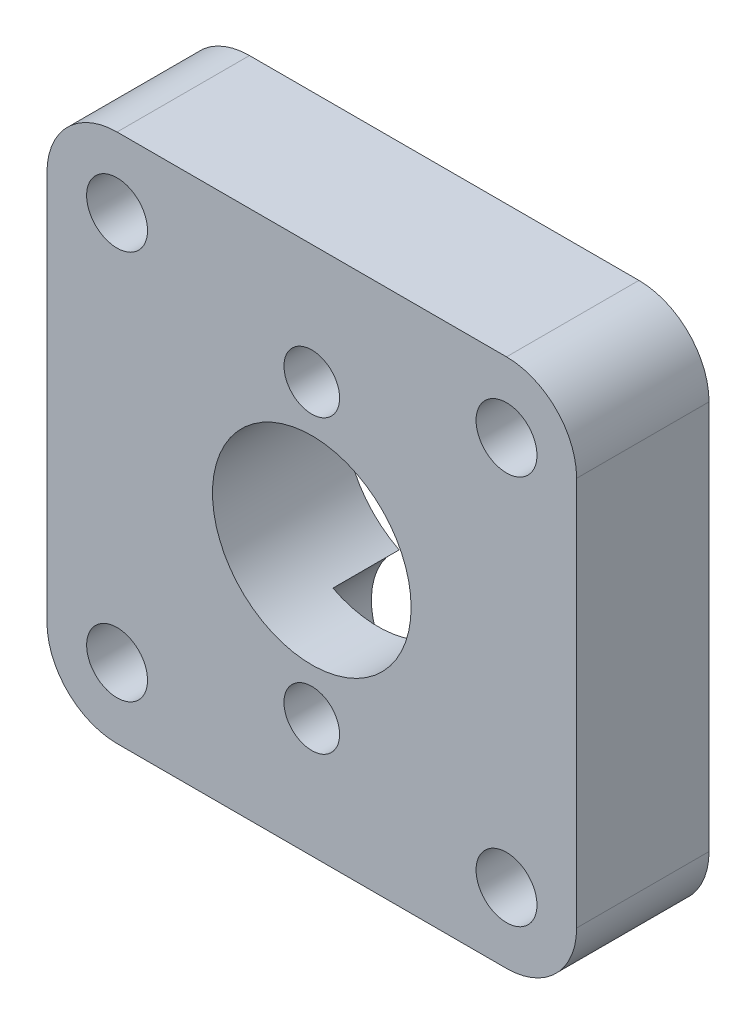
ISO-10303-21;
HEADER;
FILE_DESCRIPTION(('STEP AP214'),'2;1');
FILE_NAME('part.step','',(''),(''),'','','');
FILE_SCHEMA(('AUTOMOTIVE_DESIGN { 1 0 10303 214 1 1 1 1 }'));
ENDSEC;
DATA;
#1=APPLICATION_CONTEXT('core data for automotive mechanical design processes');
#2=APPLICATION_PROTOCOL_DEFINITION('international standard','automotive_design',2000,#1);
#3=PRODUCT_CONTEXT('',#1,'mechanical');
#4=PRODUCT('Part','Part','',(#3));
#5=PRODUCT_RELATED_PRODUCT_CATEGORY('part','',(#4));
#6=PRODUCT_DEFINITION_FORMATION('','',#4);
#7=PRODUCT_DEFINITION_CONTEXT('part definition',#1,'design');
#8=PRODUCT_DEFINITION('design','',#6,#7);
#9=PRODUCT_DEFINITION_SHAPE('','',#8);
#10=(LENGTH_UNIT() NAMED_UNIT(*) SI_UNIT(.MILLI.,.METRE.));
#11=(NAMED_UNIT(*) PLANE_ANGLE_UNIT() SI_UNIT($,.RADIAN.));
#12=(NAMED_UNIT(*) SI_UNIT($,.STERADIAN.) SOLID_ANGLE_UNIT());
#13=UNCERTAINTY_MEASURE_WITH_UNIT(LENGTH_MEASURE(1.E-05),#10,'distance_accuracy_value','');
#14=(GEOMETRIC_REPRESENTATION_CONTEXT(3) GLOBAL_UNCERTAINTY_ASSIGNED_CONTEXT((#13)) GLOBAL_UNIT_ASSIGNED_CONTEXT((#10,
#11,#12)) REPRESENTATION_CONTEXT('',''));
#15=CARTESIAN_POINT('',(0.,0.,0.));
#16=DIRECTION('',(0.,0.,1.));
#17=DIRECTION('',(1.,0.,0.));
#18=AXIS2_PLACEMENT_3D('',#15,#16,#17);
#19=CARTESIAN_POINT('',(-7.35229073212245,7.35229073212245,0.));
#20=DIRECTION('',(0.,0.,-1.));
#21=DIRECTION('',(1.,0.,0.));
#22=AXIS2_PLACEMENT_3D('',#19,#20,#21);
#23=CYLINDRICAL_SURFACE('',#22,1.15);
#24=CARTESIAN_POINT('',(-7.35229073212245,7.35229073212245,0.));
#25=DIRECTION('',(0.,0.,1.));
#26=DIRECTION('',(1.,0.,0.));
#27=AXIS2_PLACEMENT_3D('',#24,#25,#26);
#28=CIRCLE('',#27,1.15);
#29=CARTESIAN_POINT('',(-6.20229073212244,7.35229073212245,0.));
#30=VERTEX_POINT('',#29);
#31=EDGE_CURVE('E224',#30,#30,#28,.T.);
#32=ORIENTED_EDGE('',*,*,#31,.T.);
#33=EDGE_LOOP('',(#32));
#34=FACE_BOUND('',#33,.T.);
#35=CARTESIAN_POINT('',(-7.35229073212245,7.35229073212245,-2.));
#36=DIRECTION('',(0.,0.,1.));
#37=DIRECTION('',(1.,0.,0.));
#38=AXIS2_PLACEMENT_3D('',#35,#36,#37);
#39=CIRCLE('',#38,1.15);
#40=CARTESIAN_POINT('',(-6.20229073212244,7.35229073212245,-2.));
#41=VERTEX_POINT('',#40);
#42=EDGE_CURVE('E209',#41,#41,#39,.F.);
#43=ORIENTED_EDGE('',*,*,#42,.T.);
#44=EDGE_LOOP('',(#43));
#45=FACE_BOUND('',#44,.T.);
#46=ADVANCED_FACE('F39',(#34,#45),#23,.F.);
#47=CARTESIAN_POINT('',(7.35229073212245,-7.35229073212245,0.));
#48=DIRECTION('',(0.,0.,-1.));
#49=DIRECTION('',(1.,0.,0.));
#50=AXIS2_PLACEMENT_3D('',#47,#48,#49);
#51=CYLINDRICAL_SURFACE('',#50,1.15);
#52=CARTESIAN_POINT('',(7.35229073212245,-7.35229073212245,0.));
#53=DIRECTION('',(0.,0.,1.));
#54=DIRECTION('',(1.,0.,0.));
#55=AXIS2_PLACEMENT_3D('',#52,#53,#54);
#56=CIRCLE('',#55,1.15);
#57=CARTESIAN_POINT('',(8.50229073212244,-7.35229073212245,0.));
#58=VERTEX_POINT('',#57);
#59=EDGE_CURVE('E215',#58,#58,#56,.T.);
#60=ORIENTED_EDGE('',*,*,#59,.T.);
#61=EDGE_LOOP('',(#60));
#62=FACE_BOUND('',#61,.T.);
#63=CARTESIAN_POINT('',(7.35229073212245,-7.35229073212245,-2.));
#64=DIRECTION('',(0.,0.,1.));
#65=DIRECTION('',(1.,0.,0.));
#66=AXIS2_PLACEMENT_3D('',#63,#64,#65);
#67=CIRCLE('',#66,1.15);
#68=CARTESIAN_POINT('',(8.50229073212244,-7.35229073212245,-2.));
#69=VERTEX_POINT('',#68);
#70=EDGE_CURVE('E203',#69,#69,#67,.F.);
#71=ORIENTED_EDGE('',*,*,#70,.T.);
#72=EDGE_LOOP('',(#71));
#73=FACE_BOUND('',#72,.T.);
#74=ADVANCED_FACE('F305',(#62,#73),#51,.F.);
#75=CARTESIAN_POINT('',(0.,7.5,0.));
#76=DIRECTION('',(0.,0.,-1.));
#77=DIRECTION('',(1.,0.,0.));
#78=AXIS2_PLACEMENT_3D('',#75,#76,#77);
#79=PLANE('',#78);
#80=CARTESIAN_POINT('',(-7.35229073212245,-7.35229073212245,0.));
#81=DIRECTION('',(0.,0.,1.));
#82=DIRECTION('',(-1.,0.,0.));
#83=AXIS2_PLACEMENT_3D('',#80,#81,#82);
#84=CIRCLE('',#83,1.15);
#85=CARTESIAN_POINT('',(-8.50229073212244,-7.35229073212245,0.));
#86=VERTEX_POINT('',#85);
#87=EDGE_CURVE('E211',#86,#86,#84,.T.);
#88=ORIENTED_EDGE('',*,*,#87,.F.);
#89=EDGE_LOOP('',(#88));
#90=FACE_BOUND('',#89,.T.);
#91=ORIENTED_EDGE('',*,*,#59,.F.);
#92=EDGE_LOOP('',(#91));
#93=FACE_BOUND('',#92,.T.);
#94=CARTESIAN_POINT('',(7.35229073212245,7.35229073212245,0.));
#95=DIRECTION('',(0.,0.,1.));
#96=DIRECTION('',(-1.,0.,0.));
#97=AXIS2_PLACEMENT_3D('',#94,#95,#96);
#98=CIRCLE('',#97,1.15);
#99=CARTESIAN_POINT('',(6.20229073212244,7.35229073212245,0.));
#100=VERTEX_POINT('',#99);
#101=EDGE_CURVE('E220',#100,#100,#98,.T.);
#102=ORIENTED_EDGE('',*,*,#101,.F.);
#103=EDGE_LOOP('',(#102));
#104=FACE_BOUND('',#103,.T.);
#105=ORIENTED_EDGE('',*,*,#31,.F.);
#106=EDGE_LOOP('',(#105));
#107=FACE_BOUND('',#106,.T.);
#108=CARTESIAN_POINT('',(0.,5.5,0.));
#109=DIRECTION('',(0.,0.,1.));
#110=DIRECTION('',(1.,0.,0.));
#111=AXIS2_PLACEMENT_3D('',#108,#109,#110);
#112=CIRCLE('',#111,1.05);
#113=CARTESIAN_POINT('',(1.05,5.5,0.));
#114=VERTEX_POINT('',#113);
#115=EDGE_CURVE('E164',#114,#114,#112,.T.);
#116=ORIENTED_EDGE('',*,*,#115,.F.);
#117=EDGE_LOOP('',(#116));
#118=FACE_BOUND('',#117,.T.);
#119=CARTESIAN_POINT('',(0.,-5.5,0.));
#120=DIRECTION('',(0.,0.,1.));
#121=DIRECTION('',(-1.,0.,0.));
#122=AXIS2_PLACEMENT_3D('',#119,#120,#121);
#123=CIRCLE('',#122,1.05);
#124=CARTESIAN_POINT('',(-1.05,-5.5,0.));
#125=VERTEX_POINT('',#124);
#126=EDGE_CURVE('E168',#125,#125,#123,.T.);
#127=ORIENTED_EDGE('',*,*,#126,.F.);
#128=EDGE_LOOP('',(#127));
#129=FACE_BOUND('',#128,.T.);
#130=CARTESIAN_POINT('',(0.,0.,0.));
#131=DIRECTION('',(0.,0.,1.));
#132=DIRECTION('',(1.,0.,0.));
#133=AXIS2_PLACEMENT_3D('',#130,#131,#132);
#134=CIRCLE('',#133,3.75);
#135=CARTESIAN_POINT('',(3.75,0.,0.));
#136=VERTEX_POINT('',#135);
#137=EDGE_CURVE('E47',#136,#136,#134,.T.);
#138=ORIENTED_EDGE('',*,*,#137,.F.);
#139=EDGE_LOOP('',(#138));
#140=FACE_BOUND('',#139,.T.);
#141=DIRECTION('',(1.,0.,0.));
#142=VECTOR('',#141,1.);
#143=CARTESIAN_POINT('',(10.,-10.,0.));
#144=LINE('',#143,#142);
#145=CARTESIAN_POINT('',(-7.35229073212245,-10.,0.));
#146=VERTEX_POINT('',#145);
#147=CARTESIAN_POINT('',(7.35229073212244,-10.,0.));
#148=VERTEX_POINT('',#147);
#149=EDGE_CURVE('E175',#146,#148,#144,.T.);
#150=ORIENTED_EDGE('',*,*,#149,.T.);
#151=CARTESIAN_POINT('',(7.35229073212244,-7.35229073212245,0.));
#152=DIRECTION('',(0.,0.,-1.));
#153=DIRECTION('',(-1.,0.,0.));
#154=AXIS2_PLACEMENT_3D('',#151,#152,#153);
#155=CIRCLE('',#154,2.64770926787756);
#156=CARTESIAN_POINT('',(10.,-7.35229073212245,0.));
#157=VERTEX_POINT('',#156);
#158=EDGE_CURVE('E242',#157,#148,#155,.T.);
#159=ORIENTED_EDGE('',*,*,#158,.F.);
#160=DIRECTION('',(0.,1.,0.));
#161=VECTOR('',#160,1.);
#162=CARTESIAN_POINT('',(10.,-10.,0.));
#163=LINE('',#162,#161);
#164=CARTESIAN_POINT('',(10.,7.35229073212245,0.));
#165=VERTEX_POINT('',#164);
#166=EDGE_CURVE('E179',#157,#165,#163,.T.);
#167=ORIENTED_EDGE('',*,*,#166,.T.);
#168=CARTESIAN_POINT('',(7.35229073212244,7.35229073212245,0.));
#169=DIRECTION('',(0.,0.,-1.));
#170=DIRECTION('',(1.,0.,0.));
#171=AXIS2_PLACEMENT_3D('',#168,#169,#170);
#172=CIRCLE('',#171,2.64770926787756);
#173=CARTESIAN_POINT('',(7.35229073212244,10.,0.));
#174=VERTEX_POINT('',#173);
#175=EDGE_CURVE('E230',#174,#165,#172,.T.);
#176=ORIENTED_EDGE('',*,*,#175,.F.);
#177=DIRECTION('',(-1.,0.,0.));
#178=VECTOR('',#177,1.);
#179=CARTESIAN_POINT('',(10.,10.,0.));
#180=LINE('',#179,#178);
#181=CARTESIAN_POINT('',(-7.35229073212245,10.,0.));
#182=VERTEX_POINT('',#181);
#183=EDGE_CURVE('E182',#174,#182,#180,.T.);
#184=ORIENTED_EDGE('',*,*,#183,.T.);
#185=CARTESIAN_POINT('',(-7.35229073212245,7.35229073212245,0.));
#186=DIRECTION('',(0.,0.,-1.));
#187=DIRECTION('',(-1.,0.,0.));
#188=AXIS2_PLACEMENT_3D('',#185,#186,#187);
#189=CIRCLE('',#188,2.64770926787756);
#190=CARTESIAN_POINT('',(-10.,7.35229073212245,0.));
#191=VERTEX_POINT('',#190);
#192=EDGE_CURVE('E258',#191,#182,#189,.T.);
#193=ORIENTED_EDGE('',*,*,#192,.F.);
#194=DIRECTION('',(0.,-1.,0.));
#195=VECTOR('',#194,1.);
#196=CARTESIAN_POINT('',(-10.,-10.,0.));
#197=LINE('',#196,#195);
#198=CARTESIAN_POINT('',(-10.,-7.35229073212245,0.));
#199=VERTEX_POINT('',#198);
#200=EDGE_CURVE('E172',#191,#199,#197,.T.);
#201=ORIENTED_EDGE('',*,*,#200,.T.);
#202=CARTESIAN_POINT('',(-7.35229073212245,-7.35229073212245,0.));
#203=DIRECTION('',(0.,0.,-1.));
#204=DIRECTION('',(1.,0.,0.));
#205=AXIS2_PLACEMENT_3D('',#202,#203,#204);
#206=CIRCLE('',#205,2.64770926787756);
#207=EDGE_CURVE('E252',#146,#199,#206,.T.);
#208=ORIENTED_EDGE('',*,*,#207,.F.);
#209=EDGE_LOOP('',(#150,#159,#167,#176,#184,#193,#201,#208));
#210=FACE_BOUND('',#209,.T.);
#211=ADVANCED_FACE('F41',(#90,#93,#104,#107,#118,#129,#140,#210),#79,.F.);
#212=CARTESIAN_POINT('',(0.,2.,-5.));
#213=DIRECTION('',(0.,0.,1.));
#214=DIRECTION('',(-1.,0.,0.));
#215=AXIS2_PLACEMENT_3D('',#212,#213,#214);
#216=PLANE('',#215);
#217=CARTESIAN_POINT('',(-7.35229073212245,-7.35229073212244,-5.));
#218=DIRECTION('',(0.,0.,1.));
#219=DIRECTION('',(-1.,0.,0.));
#220=AXIS2_PLACEMENT_3D('',#217,#218,#219);
#221=CIRCLE('',#220,2.);
#222=CARTESIAN_POINT('',(-9.35229073212245,-7.35229073212244,-5.));
#223=VERTEX_POINT('',#222);
#224=EDGE_CURVE('E361',#223,#223,#221,.T.);
#225=ORIENTED_EDGE('',*,*,#224,.T.);
#226=EDGE_LOOP('',(#225));
#227=FACE_BOUND('',#226,.T.);
#228=CARTESIAN_POINT('',(7.35229073212243,-7.35229073212246,-5.));
#229=DIRECTION('',(0.,0.,1.));
#230=DIRECTION('',(1.,0.,0.));
#231=AXIS2_PLACEMENT_3D('',#228,#229,#230);
#232=CIRCLE('',#231,2.);
#233=CARTESIAN_POINT('',(9.35229073212243,-7.35229073212246,-5.));
#234=VERTEX_POINT('',#233);
#235=EDGE_CURVE('E365',#234,#234,#232,.T.);
#236=ORIENTED_EDGE('',*,*,#235,.T.);
#237=EDGE_LOOP('',(#236));
#238=FACE_BOUND('',#237,.T.);
#239=CARTESIAN_POINT('',(7.35229073212243,7.35229073212246,-5.));
#240=DIRECTION('',(0.,0.,1.));
#241=DIRECTION('',(-1.,0.,0.));
#242=AXIS2_PLACEMENT_3D('',#239,#240,#241);
#243=CIRCLE('',#242,2.);
#244=CARTESIAN_POINT('',(5.35229073212243,7.35229073212246,-5.));
#245=VERTEX_POINT('',#244);
#246=EDGE_CURVE('E369',#245,#245,#243,.T.);
#247=ORIENTED_EDGE('',*,*,#246,.T.);
#248=EDGE_LOOP('',(#247));
#249=FACE_BOUND('',#248,.T.);
#250=CARTESIAN_POINT('',(-7.35229073212245,7.35229073212245,-5.));
#251=DIRECTION('',(0.,0.,1.));
#252=DIRECTION('',(1.,0.,0.));
#253=AXIS2_PLACEMENT_3D('',#250,#251,#252);
#254=CIRCLE('',#253,2.);
#255=CARTESIAN_POINT('',(-5.35229073212245,7.35229073212245,-5.));
#256=VERTEX_POINT('',#255);
#257=EDGE_CURVE('E372',#256,#256,#254,.T.);
#258=ORIENTED_EDGE('',*,*,#257,.T.);
#259=EDGE_LOOP('',(#258));
#260=FACE_BOUND('',#259,.T.);
#261=CARTESIAN_POINT('',(0.,5.5,-5.));
#262=DIRECTION('',(0.,0.,1.));
#263=DIRECTION('',(1.,0.,0.));
#264=AXIS2_PLACEMENT_3D('',#261,#262,#263);
#265=CIRCLE('',#264,2.75);
#266=CARTESIAN_POINT('',(1.70318127229047,3.34090909090909,-5.));
#267=VERTEX_POINT('',#266);
#268=CARTESIAN_POINT('',(-1.70318127229047,3.34090909090909,-5.));
#269=VERTEX_POINT('',#268);
#270=EDGE_CURVE('E134',#267,#269,#265,.T.);
#271=ORIENTED_EDGE('',*,*,#270,.T.);
#272=CARTESIAN_POINT('',(0.,0.,-5.));
#273=DIRECTION('',(0.,0.,-1.));
#274=DIRECTION('',(-1.,0.,0.));
#275=AXIS2_PLACEMENT_3D('',#272,#273,#274);
#276=CIRCLE('',#275,3.75);
#277=CARTESIAN_POINT('',(-1.70318127229047,-3.34090909090909,-5.));
#278=VERTEX_POINT('',#277);
#279=EDGE_CURVE('E143',#278,#269,#276,.T.);
#280=ORIENTED_EDGE('',*,*,#279,.F.);
#281=CARTESIAN_POINT('',(0.,-5.5,-5.));
#282=DIRECTION('',(0.,0.,1.));
#283=DIRECTION('',(-1.,0.,0.));
#284=AXIS2_PLACEMENT_3D('',#281,#282,#283);
#285=CIRCLE('',#284,2.75);
#286=CARTESIAN_POINT('',(1.70318127229047,-3.34090909090909,-5.));
#287=VERTEX_POINT('',#286);
#288=EDGE_CURVE('E155',#278,#287,#285,.T.);
#289=ORIENTED_EDGE('',*,*,#288,.T.);
#290=EDGE_CURVE('E149',#267,#287,#276,.T.);
#291=ORIENTED_EDGE('',*,*,#290,.F.);
#292=EDGE_LOOP('',(#271,#280,#289,#291));
#293=FACE_BOUND('',#292,.T.);
#294=DIRECTION('',(0.,-1.,0.));
#295=VECTOR('',#294,1.);
#296=CARTESIAN_POINT('',(-10.,-10.,-5.));
#297=LINE('',#296,#295);
#298=CARTESIAN_POINT('',(-10.,7.35229073212245,-5.));
#299=VERTEX_POINT('',#298);
#300=CARTESIAN_POINT('',(-10.,-7.35229073212245,-5.));
#301=VERTEX_POINT('',#300);
#302=EDGE_CURVE('E167',#299,#301,#297,.T.);
#303=ORIENTED_EDGE('',*,*,#302,.F.);
#304=CARTESIAN_POINT('',(-7.35229073212245,7.35229073212245,-5.));
#305=DIRECTION('',(0.,0.,-1.));
#306=DIRECTION('',(-1.,0.,0.));
#307=AXIS2_PLACEMENT_3D('',#304,#305,#306);
#308=CIRCLE('',#307,2.64770926787756);
#309=CARTESIAN_POINT('',(-7.35229073212245,10.,-5.));
#310=VERTEX_POINT('',#309);
#311=EDGE_CURVE('E237',#299,#310,#308,.T.);
#312=ORIENTED_EDGE('',*,*,#311,.T.);
#313=DIRECTION('',(-1.,0.,0.));
#314=VECTOR('',#313,1.);
#315=CARTESIAN_POINT('',(10.,10.,-5.));
#316=LINE('',#315,#314);
#317=CARTESIAN_POINT('',(7.35229073212244,10.,-5.));
#318=VERTEX_POINT('',#317);
#319=EDGE_CURVE('E176',#318,#310,#316,.T.);
#320=ORIENTED_EDGE('',*,*,#319,.F.);
#321=CARTESIAN_POINT('',(7.35229073212244,7.35229073212245,-5.));
#322=DIRECTION('',(0.,0.,-1.));
#323=DIRECTION('',(1.,0.,0.));
#324=AXIS2_PLACEMENT_3D('',#321,#322,#323);
#325=CIRCLE('',#324,2.64770926787756);
#326=CARTESIAN_POINT('',(10.,7.35229073212245,-5.));
#327=VERTEX_POINT('',#326);
#328=EDGE_CURVE('E234',#318,#327,#325,.T.);
#329=ORIENTED_EDGE('',*,*,#328,.T.);
#330=DIRECTION('',(0.,1.,0.));
#331=VECTOR('',#330,1.);
#332=CARTESIAN_POINT('',(10.,-10.,-5.));
#333=LINE('',#332,#331);
#334=CARTESIAN_POINT('',(10.,-7.35229073212245,-5.));
#335=VERTEX_POINT('',#334);
#336=EDGE_CURVE('E190',#335,#327,#333,.T.);
#337=ORIENTED_EDGE('',*,*,#336,.F.);
#338=CARTESIAN_POINT('',(7.35229073212244,-7.35229073212245,-5.));
#339=DIRECTION('',(0.,0.,-1.));
#340=DIRECTION('',(-1.,0.,0.));
#341=AXIS2_PLACEMENT_3D('',#338,#339,#340);
#342=CIRCLE('',#341,2.64770926787756);
#343=CARTESIAN_POINT('',(7.35229073212244,-10.,-5.));
#344=VERTEX_POINT('',#343);
#345=EDGE_CURVE('E233',#335,#344,#342,.T.);
#346=ORIENTED_EDGE('',*,*,#345,.T.);
#347=DIRECTION('',(1.,0.,0.));
#348=VECTOR('',#347,1.);
#349=CARTESIAN_POINT('',(10.,-10.,-5.));
#350=LINE('',#349,#348);
#351=CARTESIAN_POINT('',(-7.35229073212245,-10.,-5.));
#352=VERTEX_POINT('',#351);
#353=EDGE_CURVE('E187',#352,#344,#350,.T.);
#354=ORIENTED_EDGE('',*,*,#353,.F.);
#355=CARTESIAN_POINT('',(-7.35229073212245,-7.35229073212245,-5.));
#356=DIRECTION('',(0.,0.,-1.));
#357=DIRECTION('',(1.,0.,0.));
#358=AXIS2_PLACEMENT_3D('',#355,#356,#357);
#359=CIRCLE('',#358,2.64770926787756);
#360=EDGE_CURVE('E245',#352,#301,#359,.T.);
#361=ORIENTED_EDGE('',*,*,#360,.T.);
#362=EDGE_LOOP('',(#303,#312,#320,#329,#337,#346,#354,#361));
#363=FACE_BOUND('',#362,.T.);
#364=ADVANCED_FACE('F152',(#227,#238,#249,#260,#293,#363),#216,.F.);
#365=CARTESIAN_POINT('',(0.,5.5,0.));
#366=DIRECTION('',(0.,0.,-1.));
#367=DIRECTION('',(1.,0.,0.));
#368=AXIS2_PLACEMENT_3D('',#365,#366,#367);
#369=CYLINDRICAL_SURFACE('',#368,1.05);
#370=ORIENTED_EDGE('',*,*,#115,.T.);
#371=EDGE_LOOP('',(#370));
#372=FACE_BOUND('',#371,.T.);
#373=CARTESIAN_POINT('',(0.,5.5,-2.5));
#374=DIRECTION('',(0.,0.,1.));
#375=DIRECTION('',(1.,0.,0.));
#376=AXIS2_PLACEMENT_3D('',#373,#374,#375);
#377=CIRCLE('',#376,1.05);
#378=CARTESIAN_POINT('',(1.05,5.5,-2.5));
#379=VERTEX_POINT('',#378);
#380=EDGE_CURVE('E157',#379,#379,#377,.F.);
#381=ORIENTED_EDGE('',*,*,#380,.T.);
#382=EDGE_LOOP('',(#381));
#383=FACE_BOUND('',#382,.T.);
#384=ADVANCED_FACE('F339',(#372,#383),#369,.F.);
#385=CARTESIAN_POINT('',(0.,0.,-12.6));
#386=DIRECTION('',(0.,0.,-1.));
#387=DIRECTION('',(1.,0.,0.));
#388=AXIS2_PLACEMENT_3D('',#385,#386,#387);
#389=CYLINDRICAL_SURFACE('',#388,3.75);
#390=ORIENTED_EDGE('',*,*,#137,.T.);
#391=EDGE_LOOP('',(#390));
#392=FACE_BOUND('',#391,.T.);
#393=CARTESIAN_POINT('',(0.,0.,-2.5));
#394=DIRECTION('',(0.,0.,1.));
#395=DIRECTION('',(1.,0.,0.));
#396=AXIS2_PLACEMENT_3D('',#393,#394,#395);
#397=CIRCLE('',#396,3.75);
#398=CARTESIAN_POINT('',(1.70318127229047,3.34090909090909,-2.5));
#399=VERTEX_POINT('',#398);
#400=CARTESIAN_POINT('',(-1.70318127229047,3.34090909090909,-2.5));
#401=VERTEX_POINT('',#400);
#402=EDGE_CURVE('E140',#399,#401,#397,.T.);
#403=ORIENTED_EDGE('',*,*,#402,.F.);
#404=DIRECTION('',(0.,0.,1.));
#405=VECTOR('',#404,1.);
#406=CARTESIAN_POINT('',(1.70318127229047,3.34090909090909,-2.5));
#407=LINE('',#406,#405);
#408=EDGE_CURVE('E139',#399,#267,#407,.F.);
#409=ORIENTED_EDGE('',*,*,#408,.T.);
#410=ORIENTED_EDGE('',*,*,#290,.T.);
#411=DIRECTION('',(0.,0.,1.));
#412=VECTOR('',#411,1.);
#413=CARTESIAN_POINT('',(1.70318127229047,-3.34090909090909,-2.5));
#414=LINE('',#413,#412);
#415=CARTESIAN_POINT('',(1.70318127229047,-3.34090909090909,-2.5));
#416=VERTEX_POINT('',#415);
#417=EDGE_CURVE('E454',#287,#416,#414,.T.);
#418=ORIENTED_EDGE('',*,*,#417,.T.);
#419=CARTESIAN_POINT('',(0.,0.,-2.5));
#420=DIRECTION('',(0.,0.,-1.));
#421=DIRECTION('',(-1.,0.,0.));
#422=AXIS2_PLACEMENT_3D('',#419,#420,#421);
#423=CIRCLE('',#422,3.75);
#424=CARTESIAN_POINT('',(-1.70318127229047,-3.34090909090909,-2.5));
#425=VERTEX_POINT('',#424);
#426=EDGE_CURVE('E11',#416,#425,#423,.T.);
#427=ORIENTED_EDGE('',*,*,#426,.T.);
#428=DIRECTION('',(0.,0.,1.));
#429=VECTOR('',#428,1.);
#430=CARTESIAN_POINT('',(-1.70318127229047,-3.34090909090909,-2.5));
#431=LINE('',#430,#429);
#432=EDGE_CURVE('E145',#425,#278,#431,.F.);
#433=ORIENTED_EDGE('',*,*,#432,.T.);
#434=ORIENTED_EDGE('',*,*,#279,.T.);
#435=DIRECTION('',(0.,0.,1.));
#436=VECTOR('',#435,1.);
#437=CARTESIAN_POINT('',(-1.70318127229047,3.34090909090909,-2.5));
#438=LINE('',#437,#436);
#439=EDGE_CURVE('E129',#269,#401,#438,.T.);
#440=ORIENTED_EDGE('',*,*,#439,.T.);
#441=EDGE_LOOP('',(#403,#409,#410,#418,#427,#433,#434,#440));
#442=FACE_BOUND('',#441,.T.);
#443=ADVANCED_FACE('F144',(#392,#442),#389,.F.);
#444=CARTESIAN_POINT('',(-10.,-10.,0.));
#445=DIRECTION('',(-1.,0.,0.));
#446=DIRECTION('',(0.,0.,-1.));
#447=AXIS2_PLACEMENT_3D('',#444,#445,#446);
#448=PLANE('',#447);
#449=DIRECTION('',(0.,0.,-1.));
#450=VECTOR('',#449,1.);
#451=CARTESIAN_POINT('',(-10.,-7.35229073212245,0.));
#452=LINE('',#451,#450);
#453=EDGE_CURVE('E227',#199,#301,#452,.T.);
#454=ORIENTED_EDGE('',*,*,#453,.F.);
#455=ORIENTED_EDGE('',*,*,#200,.F.);
#456=DIRECTION('',(0.,0.,-1.));
#457=VECTOR('',#456,1.);
#458=CARTESIAN_POINT('',(-10.,7.35229073212245,0.));
#459=LINE('',#458,#457);
#460=EDGE_CURVE('E163',#191,#299,#459,.T.);
#461=ORIENTED_EDGE('',*,*,#460,.T.);
#462=ORIENTED_EDGE('',*,*,#302,.T.);
#463=EDGE_LOOP('',(#454,#455,#461,#462));
#464=FACE_BOUND('',#463,.T.);
#465=ADVANCED_FACE('F264',(#464),#448,.T.);
#466=CARTESIAN_POINT('',(10.,10.,0.));
#467=DIRECTION('',(0.,1.,0.));
#468=DIRECTION('',(0.,0.,-1.));
#469=AXIS2_PLACEMENT_3D('',#466,#467,#468);
#470=PLANE('',#469);
#471=DIRECTION('',(0.,0.,-1.));
#472=VECTOR('',#471,1.);
#473=CARTESIAN_POINT('',(7.35229073212244,10.,0.));
#474=LINE('',#473,#472);
#475=EDGE_CURVE('E228',#174,#318,#474,.T.);
#476=ORIENTED_EDGE('',*,*,#475,.T.);
#477=ORIENTED_EDGE('',*,*,#319,.T.);
#478=DIRECTION('',(0.,0.,-1.));
#479=VECTOR('',#478,1.);
#480=CARTESIAN_POINT('',(-7.35229073212245,10.,0.));
#481=LINE('',#480,#479);
#482=EDGE_CURVE('E61',#182,#310,#481,.T.);
#483=ORIENTED_EDGE('',*,*,#482,.F.);
#484=ORIENTED_EDGE('',*,*,#183,.F.);
#485=EDGE_LOOP('',(#476,#477,#483,#484));
#486=FACE_BOUND('',#485,.T.);
#487=ADVANCED_FACE('F279',(#486),#470,.T.);
#488=CARTESIAN_POINT('',(10.,-10.,0.));
#489=DIRECTION('',(1.,0.,0.));
#490=DIRECTION('',(0.,0.,1.));
#491=AXIS2_PLACEMENT_3D('',#488,#489,#490);
#492=PLANE('',#491);
#493=DIRECTION('',(0.,0.,-1.));
#494=VECTOR('',#493,1.);
#495=CARTESIAN_POINT('',(10.,-7.35229073212245,0.));
#496=LINE('',#495,#494);
#497=EDGE_CURVE('E240',#157,#335,#496,.T.);
#498=ORIENTED_EDGE('',*,*,#497,.T.);
#499=ORIENTED_EDGE('',*,*,#336,.T.);
#500=DIRECTION('',(0.,0.,-1.));
#501=VECTOR('',#500,1.);
#502=CARTESIAN_POINT('',(10.,7.35229073212245,0.));
#503=LINE('',#502,#501);
#504=EDGE_CURVE('E231',#165,#327,#503,.T.);
#505=ORIENTED_EDGE('',*,*,#504,.F.);
#506=ORIENTED_EDGE('',*,*,#166,.F.);
#507=EDGE_LOOP('',(#498,#499,#505,#506));
#508=FACE_BOUND('',#507,.T.);
#509=ADVANCED_FACE('F286',(#508),#492,.T.);
#510=CARTESIAN_POINT('',(10.,-10.,0.));
#511=DIRECTION('',(0.,-1.,0.));
#512=DIRECTION('',(0.,0.,1.));
#513=AXIS2_PLACEMENT_3D('',#510,#511,#512);
#514=PLANE('',#513);
#515=DIRECTION('',(0.,0.,-1.));
#516=VECTOR('',#515,1.);
#517=CARTESIAN_POINT('',(-7.35229073212245,-10.,0.));
#518=LINE('',#517,#516);
#519=EDGE_CURVE('E250',#146,#352,#518,.T.);
#520=ORIENTED_EDGE('',*,*,#519,.T.);
#521=ORIENTED_EDGE('',*,*,#353,.T.);
#522=DIRECTION('',(0.,0.,-1.));
#523=VECTOR('',#522,1.);
#524=CARTESIAN_POINT('',(7.35229073212244,-10.,0.));
#525=LINE('',#524,#523);
#526=EDGE_CURVE('E243',#148,#344,#525,.T.);
#527=ORIENTED_EDGE('',*,*,#526,.F.);
#528=ORIENTED_EDGE('',*,*,#149,.F.);
#529=EDGE_LOOP('',(#520,#521,#527,#528));
#530=FACE_BOUND('',#529,.T.);
#531=ADVANCED_FACE('F292',(#530),#514,.T.);
#532=CARTESIAN_POINT('',(0.,-5.5,0.));
#533=DIRECTION('',(0.,0.,-1.));
#534=DIRECTION('',(1.,0.,0.));
#535=AXIS2_PLACEMENT_3D('',#532,#533,#534);
#536=CYLINDRICAL_SURFACE('',#535,1.05);
#537=CARTESIAN_POINT('',(0.,-5.5,-2.5));
#538=DIRECTION('',(0.,0.,-1.));
#539=DIRECTION('',(-1.,0.,0.));
#540=AXIS2_PLACEMENT_3D('',#537,#538,#539);
#541=CIRCLE('',#540,1.05);
#542=CARTESIAN_POINT('',(-1.05,-5.5,-2.5));
#543=VERTEX_POINT('',#542);
#544=EDGE_CURVE('E171',#543,#543,#541,.F.);
#545=ORIENTED_EDGE('',*,*,#544,.F.);
#546=EDGE_LOOP('',(#545));
#547=FACE_BOUND('',#546,.T.);
#548=ORIENTED_EDGE('',*,*,#126,.T.);
#549=EDGE_LOOP('',(#548));
#550=FACE_BOUND('',#549,.T.);
#551=ADVANCED_FACE('F294',(#547,#550),#536,.F.);
#552=CARTESIAN_POINT('',(0.,5.5,-2.5));
#553=DIRECTION('',(0.,0.,-1.));
#554=DIRECTION('',(1.,0.,0.));
#555=AXIS2_PLACEMENT_3D('',#552,#553,#554);
#556=CYLINDRICAL_SURFACE('',#555,2.75);
#557=CARTESIAN_POINT('',(0.,5.5,-2.5));
#558=DIRECTION('',(0.,0.,1.));
#559=DIRECTION('',(1.,0.,0.));
#560=AXIS2_PLACEMENT_3D('',#557,#558,#559);
#561=CIRCLE('',#560,2.75);
#562=EDGE_CURVE('E135',#399,#401,#561,.T.);
#563=ORIENTED_EDGE('',*,*,#562,.T.);
#564=ORIENTED_EDGE('',*,*,#439,.F.);
#565=ORIENTED_EDGE('',*,*,#270,.F.);
#566=ORIENTED_EDGE('',*,*,#408,.F.);
#567=EDGE_LOOP('',(#563,#564,#565,#566));
#568=FACE_BOUND('',#567,.T.);
#569=ADVANCED_FACE('F131',(#568),#556,.F.);
#570=CARTESIAN_POINT('',(0.,5.5,-2.5));
#571=DIRECTION('',(0.,0.,-1.));
#572=DIRECTION('',(1.,0.,0.));
#573=AXIS2_PLACEMENT_3D('',#570,#571,#572);
#574=PLANE('',#573);
#575=ORIENTED_EDGE('',*,*,#402,.T.);
#576=ORIENTED_EDGE('',*,*,#562,.F.);
#577=EDGE_LOOP('',(#575,#576));
#578=FACE_BOUND('',#577,.T.);
#579=ORIENTED_EDGE('',*,*,#380,.F.);
#580=EDGE_LOOP('',(#579));
#581=FACE_BOUND('',#580,.T.);
#582=ADVANCED_FACE('F326',(#578,#581),#574,.T.);
#583=CARTESIAN_POINT('',(0.,-5.5,-2.5));
#584=DIRECTION('',(0.,0.,-1.));
#585=DIRECTION('',(1.,0.,0.));
#586=AXIS2_PLACEMENT_3D('',#583,#584,#585);
#587=CYLINDRICAL_SURFACE('',#586,2.75);
#588=CARTESIAN_POINT('',(0.,-5.5,-2.5));
#589=DIRECTION('',(0.,0.,1.));
#590=DIRECTION('',(-1.,0.,0.));
#591=AXIS2_PLACEMENT_3D('',#588,#589,#590);
#592=CIRCLE('',#591,2.75);
#593=EDGE_CURVE('E53',#425,#416,#592,.T.);
#594=ORIENTED_EDGE('',*,*,#593,.T.);
#595=ORIENTED_EDGE('',*,*,#417,.F.);
#596=ORIENTED_EDGE('',*,*,#288,.F.);
#597=ORIENTED_EDGE('',*,*,#432,.F.);
#598=EDGE_LOOP('',(#594,#595,#596,#597));
#599=FACE_BOUND('',#598,.T.);
#600=ADVANCED_FACE('F329',(#599),#587,.F.);
#601=CARTESIAN_POINT('',(0.,-5.5,-2.5));
#602=DIRECTION('',(0.,0.,1.));
#603=DIRECTION('',(-1.,0.,0.));
#604=AXIS2_PLACEMENT_3D('',#601,#602,#603);
#605=PLANE('',#604);
#606=ORIENTED_EDGE('',*,*,#544,.T.);
#607=EDGE_LOOP('',(#606));
#608=FACE_BOUND('',#607,.T.);
#609=ORIENTED_EDGE('',*,*,#593,.F.);
#610=ORIENTED_EDGE('',*,*,#426,.F.);
#611=EDGE_LOOP('',(#609,#610));
#612=FACE_BOUND('',#611,.T.);
#613=ADVANCED_FACE('F320',(#608,#612),#605,.F.);
#614=CARTESIAN_POINT('',(7.35229073212244,-7.35229073212245,0.));
#615=DIRECTION('',(0.,0.,-1.));
#616=DIRECTION('',(1.,0.,0.));
#617=AXIS2_PLACEMENT_3D('',#614,#615,#616);
#618=CYLINDRICAL_SURFACE('',#617,2.64770926787756);
#619=ORIENTED_EDGE('',*,*,#345,.F.);
#620=ORIENTED_EDGE('',*,*,#497,.F.);
#621=ORIENTED_EDGE('',*,*,#158,.T.);
#622=ORIENTED_EDGE('',*,*,#526,.T.);
#623=EDGE_LOOP('',(#619,#620,#621,#622));
#624=FACE_BOUND('',#623,.T.);
#625=ADVANCED_FACE('F290',(#624),#618,.T.);
#626=CARTESIAN_POINT('',(-7.35229073212245,-7.35229073212245,0.));
#627=DIRECTION('',(0.,0.,-1.));
#628=DIRECTION('',(1.,0.,0.));
#629=AXIS2_PLACEMENT_3D('',#626,#627,#628);
#630=CYLINDRICAL_SURFACE('',#629,2.64770926787756);
#631=ORIENTED_EDGE('',*,*,#360,.F.);
#632=ORIENTED_EDGE('',*,*,#519,.F.);
#633=ORIENTED_EDGE('',*,*,#207,.T.);
#634=ORIENTED_EDGE('',*,*,#453,.T.);
#635=EDGE_LOOP('',(#631,#632,#633,#634));
#636=FACE_BOUND('',#635,.T.);
#637=ADVANCED_FACE('F272',(#636),#630,.T.);
#638=CARTESIAN_POINT('',(7.35229073212244,7.35229073212245,0.));
#639=DIRECTION('',(0.,0.,-1.));
#640=DIRECTION('',(1.,0.,0.));
#641=AXIS2_PLACEMENT_3D('',#638,#639,#640);
#642=CYLINDRICAL_SURFACE('',#641,2.64770926787756);
#643=ORIENTED_EDGE('',*,*,#328,.F.);
#644=ORIENTED_EDGE('',*,*,#475,.F.);
#645=ORIENTED_EDGE('',*,*,#175,.T.);
#646=ORIENTED_EDGE('',*,*,#504,.T.);
#647=EDGE_LOOP('',(#643,#644,#645,#646));
#648=FACE_BOUND('',#647,.T.);
#649=ADVANCED_FACE('F283',(#648),#642,.T.);
#650=CARTESIAN_POINT('',(-7.35229073212245,7.35229073212245,0.));
#651=DIRECTION('',(0.,0.,-1.));
#652=DIRECTION('',(1.,0.,0.));
#653=AXIS2_PLACEMENT_3D('',#650,#651,#652);
#654=CYLINDRICAL_SURFACE('',#653,2.64770926787756);
#655=ORIENTED_EDGE('',*,*,#311,.F.);
#656=ORIENTED_EDGE('',*,*,#460,.F.);
#657=ORIENTED_EDGE('',*,*,#192,.T.);
#658=ORIENTED_EDGE('',*,*,#482,.T.);
#659=EDGE_LOOP('',(#655,#656,#657,#658));
#660=FACE_BOUND('',#659,.T.);
#661=ADVANCED_FACE('F267',(#660),#654,.T.);
#662=CARTESIAN_POINT('',(7.35229073212245,7.35229073212245,0.));
#663=DIRECTION('',(0.,0.,-1.));
#664=DIRECTION('',(1.,0.,0.));
#665=AXIS2_PLACEMENT_3D('',#662,#663,#664);
#666=CYLINDRICAL_SURFACE('',#665,1.15);
#667=CARTESIAN_POINT('',(7.35229073212245,7.35229073212245,-2.));
#668=DIRECTION('',(0.,0.,-1.));
#669=DIRECTION('',(-1.,0.,0.));
#670=AXIS2_PLACEMENT_3D('',#667,#668,#669);
#671=CIRCLE('',#670,1.15);
#672=CARTESIAN_POINT('',(6.20229073212244,7.35229073212245,-2.));
#673=VERTEX_POINT('',#672);
#674=EDGE_CURVE('E207',#673,#673,#671,.F.);
#675=ORIENTED_EDGE('',*,*,#674,.F.);
#676=EDGE_LOOP('',(#675));
#677=FACE_BOUND('',#676,.T.);
#678=ORIENTED_EDGE('',*,*,#101,.T.);
#679=EDGE_LOOP('',(#678));
#680=FACE_BOUND('',#679,.T.);
#681=ADVANCED_FACE('F325',(#677,#680),#666,.F.);
#682=CARTESIAN_POINT('',(-7.35229073212245,-7.35229073212245,0.));
#683=DIRECTION('',(0.,0.,-1.));
#684=DIRECTION('',(1.,0.,0.));
#685=AXIS2_PLACEMENT_3D('',#682,#683,#684);
#686=CYLINDRICAL_SURFACE('',#685,1.15);
#687=CARTESIAN_POINT('',(-7.35229073212245,-7.35229073212245,-2.));
#688=DIRECTION('',(0.,0.,-1.));
#689=DIRECTION('',(-1.,0.,0.));
#690=AXIS2_PLACEMENT_3D('',#687,#688,#689);
#691=CIRCLE('',#690,1.15);
#692=CARTESIAN_POINT('',(-8.50229073212244,-7.35229073212245,-2.));
#693=VERTEX_POINT('',#692);
#694=EDGE_CURVE('E200',#693,#693,#691,.F.);
#695=ORIENTED_EDGE('',*,*,#694,.F.);
#696=EDGE_LOOP('',(#695));
#697=FACE_BOUND('',#696,.T.);
#698=ORIENTED_EDGE('',*,*,#87,.T.);
#699=EDGE_LOOP('',(#698));
#700=FACE_BOUND('',#699,.T.);
#701=ADVANCED_FACE('F315',(#697,#700),#686,.F.);
#702=CARTESIAN_POINT('',(-7.35229073212245,-7.35229073212244,-2.));
#703=DIRECTION('',(0.,0.,1.));
#704=DIRECTION('',(-1.,0.,0.));
#705=AXIS2_PLACEMENT_3D('',#702,#703,#704);
#706=PLANE('',#705);
#707=CARTESIAN_POINT('',(-7.35229073212245,-7.35229073212244,-2.));
#708=DIRECTION('',(0.,0.,1.));
#709=DIRECTION('',(-1.,0.,0.));
#710=AXIS2_PLACEMENT_3D('',#707,#708,#709);
#711=CIRCLE('',#710,2.);
#712=CARTESIAN_POINT('',(-9.35229073212245,-7.35229073212244,-2.));
#713=VERTEX_POINT('',#712);
#714=EDGE_CURVE('E448',#713,#713,#711,.T.);
#715=ORIENTED_EDGE('',*,*,#714,.F.);
#716=EDGE_LOOP('',(#715));
#717=FACE_BOUND('',#716,.T.);
#718=ORIENTED_EDGE('',*,*,#694,.T.);
#719=EDGE_LOOP('',(#718));
#720=FACE_BOUND('',#719,.T.);
#721=ADVANCED_FACE('F402',(#717,#720),#706,.F.);
#722=CARTESIAN_POINT('',(-7.35229073212245,-7.35229073212244,-2.));
#723=DIRECTION('',(0.,0.,-1.));
#724=DIRECTION('',(1.,0.,0.));
#725=AXIS2_PLACEMENT_3D('',#722,#723,#724);
#726=CYLINDRICAL_SURFACE('',#725,2.);
#727=ORIENTED_EDGE('',*,*,#714,.T.);
#728=EDGE_LOOP('',(#727));
#729=FACE_BOUND('',#728,.T.);
#730=ORIENTED_EDGE('',*,*,#224,.F.);
#731=EDGE_LOOP('',(#730));
#732=FACE_BOUND('',#731,.T.);
#733=ADVANCED_FACE('F417',(#729,#732),#726,.F.);
#734=CARTESIAN_POINT('',(7.35229073212243,-7.35229073212246,-2.));
#735=DIRECTION('',(0.,0.,-1.));
#736=DIRECTION('',(1.,0.,0.));
#737=AXIS2_PLACEMENT_3D('',#734,#735,#736);
#738=PLANE('',#737);
#739=CARTESIAN_POINT('',(7.35229073212243,-7.35229073212246,-2.));
#740=DIRECTION('',(0.,0.,1.));
#741=DIRECTION('',(1.,0.,0.));
#742=AXIS2_PLACEMENT_3D('',#739,#740,#741);
#743=CIRCLE('',#742,2.);
#744=CARTESIAN_POINT('',(9.35229073212243,-7.35229073212246,-2.));
#745=VERTEX_POINT('',#744);
#746=EDGE_CURVE('E442',#745,#745,#743,.T.);
#747=ORIENTED_EDGE('',*,*,#746,.F.);
#748=EDGE_LOOP('',(#747));
#749=FACE_BOUND('',#748,.T.);
#750=ORIENTED_EDGE('',*,*,#70,.F.);
#751=EDGE_LOOP('',(#750));
#752=FACE_BOUND('',#751,.T.);
#753=ADVANCED_FACE('F421',(#749,#752),#738,.T.);
#754=CARTESIAN_POINT('',(7.35229073212243,-7.35229073212246,-2.));
#755=DIRECTION('',(0.,0.,-1.));
#756=DIRECTION('',(1.,0.,0.));
#757=AXIS2_PLACEMENT_3D('',#754,#755,#756);
#758=CYLINDRICAL_SURFACE('',#757,2.);
#759=ORIENTED_EDGE('',*,*,#746,.T.);
#760=EDGE_LOOP('',(#759));
#761=FACE_BOUND('',#760,.T.);
#762=ORIENTED_EDGE('',*,*,#235,.F.);
#763=EDGE_LOOP('',(#762));
#764=FACE_BOUND('',#763,.T.);
#765=ADVANCED_FACE('F425',(#761,#764),#758,.F.);
#766=CARTESIAN_POINT('',(7.35229073212243,7.35229073212246,-2.));
#767=DIRECTION('',(0.,0.,1.));
#768=DIRECTION('',(-1.,0.,0.));
#769=AXIS2_PLACEMENT_3D('',#766,#767,#768);
#770=PLANE('',#769);
#771=CARTESIAN_POINT('',(7.35229073212243,7.35229073212246,-2.));
#772=DIRECTION('',(0.,0.,1.));
#773=DIRECTION('',(-1.,0.,0.));
#774=AXIS2_PLACEMENT_3D('',#771,#772,#773);
#775=CIRCLE('',#774,2.);
#776=CARTESIAN_POINT('',(5.35229073212243,7.35229073212246,-2.));
#777=VERTEX_POINT('',#776);
#778=EDGE_CURVE('E377',#777,#777,#775,.T.);
#779=ORIENTED_EDGE('',*,*,#778,.F.);
#780=EDGE_LOOP('',(#779));
#781=FACE_BOUND('',#780,.T.);
#782=ORIENTED_EDGE('',*,*,#674,.T.);
#783=EDGE_LOOP('',(#782));
#784=FACE_BOUND('',#783,.T.);
#785=ADVANCED_FACE('F429',(#781,#784),#770,.F.);
#786=CARTESIAN_POINT('',(7.35229073212243,7.35229073212246,-2.));
#787=DIRECTION('',(0.,0.,-1.));
#788=DIRECTION('',(1.,0.,0.));
#789=AXIS2_PLACEMENT_3D('',#786,#787,#788);
#790=CYLINDRICAL_SURFACE('',#789,2.);
#791=ORIENTED_EDGE('',*,*,#778,.T.);
#792=EDGE_LOOP('',(#791));
#793=FACE_BOUND('',#792,.T.);
#794=ORIENTED_EDGE('',*,*,#246,.F.);
#795=EDGE_LOOP('',(#794));
#796=FACE_BOUND('',#795,.T.);
#797=ADVANCED_FACE('F413',(#793,#796),#790,.F.);
#798=CARTESIAN_POINT('',(-7.35229073212245,7.35229073212245,-2.));
#799=DIRECTION('',(0.,0.,-1.));
#800=DIRECTION('',(1.,0.,0.));
#801=AXIS2_PLACEMENT_3D('',#798,#799,#800);
#802=PLANE('',#801);
#803=CARTESIAN_POINT('',(-7.35229073212245,7.35229073212245,-2.));
#804=DIRECTION('',(0.,0.,1.));
#805=DIRECTION('',(1.,0.,0.));
#806=AXIS2_PLACEMENT_3D('',#803,#804,#805);
#807=CIRCLE('',#806,2.);
#808=CARTESIAN_POINT('',(-5.35229073212245,7.35229073212245,-2.));
#809=VERTEX_POINT('',#808);
#810=EDGE_CURVE('E204',#809,#809,#807,.T.);
#811=ORIENTED_EDGE('',*,*,#810,.F.);
#812=EDGE_LOOP('',(#811));
#813=FACE_BOUND('',#812,.T.);
#814=ORIENTED_EDGE('',*,*,#42,.F.);
#815=EDGE_LOOP('',(#814));
#816=FACE_BOUND('',#815,.T.);
#817=ADVANCED_FACE('F409',(#813,#816),#802,.T.);
#818=CARTESIAN_POINT('',(-7.35229073212245,7.35229073212245,-2.));
#819=DIRECTION('',(0.,0.,-1.));
#820=DIRECTION('',(1.,0.,0.));
#821=AXIS2_PLACEMENT_3D('',#818,#819,#820);
#822=CYLINDRICAL_SURFACE('',#821,2.);
#823=ORIENTED_EDGE('',*,*,#810,.T.);
#824=EDGE_LOOP('',(#823));
#825=FACE_BOUND('',#824,.T.);
#826=ORIENTED_EDGE('',*,*,#257,.F.);
#827=EDGE_LOOP('',(#826));
#828=FACE_BOUND('',#827,.T.);
#829=ADVANCED_FACE('F406',(#825,#828),#822,.F.);
#830=CLOSED_SHELL('',(#46,#74,#211,#364,#384,#443,#465,#487,#509,#531,#551,#569,#582,#600,#613,
#625,#637,#649,#661,#681,#701,#721,#733,#753,#765,#785,#797,#817,#829));
#831=MANIFOLD_SOLID_BREP('B2',#830);
#832=ADVANCED_BREP_SHAPE_REPRESENTATION('',(#18,#831),#14);
#833=SHAPE_DEFINITION_REPRESENTATION(#9,#832);
ENDSEC;
END-ISO-10303-21;
